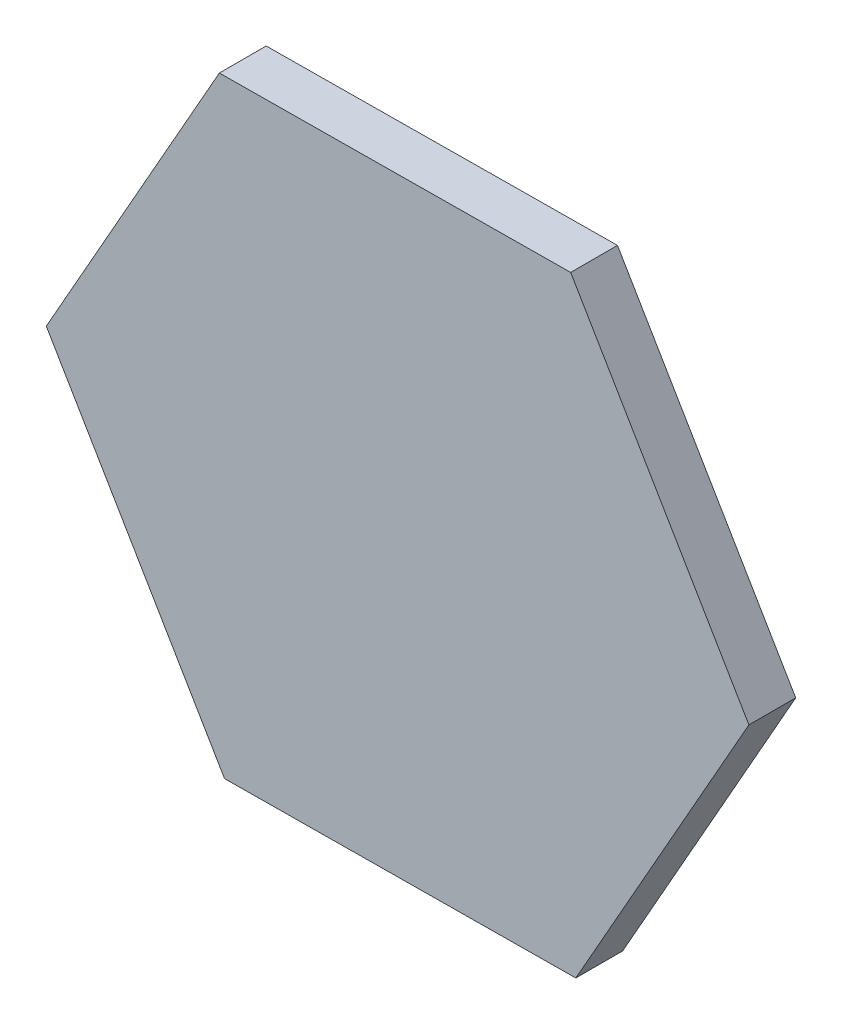
ISO-10303-21;
HEADER;
FILE_DESCRIPTION(('STEP AP214'),'2;1');
FILE_NAME('part.step','',(''),(''),'','','');
FILE_SCHEMA(('AUTOMOTIVE_DESIGN { 1 0 10303 214 1 1 1 1 }'));
ENDSEC;
DATA;
#1=APPLICATION_CONTEXT('core data for automotive mechanical design processes');
#2=APPLICATION_PROTOCOL_DEFINITION('international standard','automotive_design',2000,#1);
#3=PRODUCT_CONTEXT('',#1,'mechanical');
#4=PRODUCT('Part','Part','',(#3));
#5=PRODUCT_RELATED_PRODUCT_CATEGORY('part','',(#4));
#6=PRODUCT_DEFINITION_FORMATION('','',#4);
#7=PRODUCT_DEFINITION_CONTEXT('part definition',#1,'design');
#8=PRODUCT_DEFINITION('design','',#6,#7);
#9=PRODUCT_DEFINITION_SHAPE('','',#8);
#10=(LENGTH_UNIT() NAMED_UNIT(*) SI_UNIT(.MILLI.,.METRE.));
#11=(NAMED_UNIT(*) PLANE_ANGLE_UNIT() SI_UNIT($,.RADIAN.));
#12=(NAMED_UNIT(*) SI_UNIT($,.STERADIAN.) SOLID_ANGLE_UNIT());
#13=UNCERTAINTY_MEASURE_WITH_UNIT(LENGTH_MEASURE(1.E-05),#10,'distance_accuracy_value','');
#14=(GEOMETRIC_REPRESENTATION_CONTEXT(3) GLOBAL_UNCERTAINTY_ASSIGNED_CONTEXT((#13)) GLOBAL_UNIT_ASSIGNED_CONTEXT((#10,
#11,#12)) REPRESENTATION_CONTEXT('',''));
#15=CARTESIAN_POINT('',(0.,0.,0.));
#16=DIRECTION('',(0.,0.,1.));
#17=DIRECTION('',(1.,0.,0.));
#18=AXIS2_PLACEMENT_3D('',#15,#16,#17);
#19=CARTESIAN_POINT('',(-7.50528285653604,-0.0637383457540854,1.));
#20=DIRECTION('',(0.861748096783526,0.507336394998399,0.));
#21=DIRECTION('',(-0.507336394998399,0.861748096783526,0.));
#22=AXIS2_PLACEMENT_3D('',#19,#20,#21);
#23=PLANE('',#22);
#24=DIRECTION('',(0.507336394998399,-0.861748096783526,0.));
#25=VECTOR('',#24,1.);
#26=CARTESIAN_POINT('',(-7.50528285653604,-0.0637383457540854,0.));
#27=LINE('',#26,#25);
#28=CARTESIAN_POINT('',(-7.50528285653604,-0.0637383457540854,0.));
#29=VERTEX_POINT('',#28);
#30=CARTESIAN_POINT('',(-3.69744240164979,-6.5316347892251,0.));
#31=VERTEX_POINT('',#30);
#32=EDGE_CURVE('E123',#29,#31,#27,.T.);
#33=ORIENTED_EDGE('',*,*,#32,.T.);
#34=DIRECTION('',(0.,0.,-1.));
#35=VECTOR('',#34,1.);
#36=CARTESIAN_POINT('',(-3.69744240164979,-6.5316347892251,1.));
#37=LINE('',#36,#35);
#38=CARTESIAN_POINT('',(-3.69744240164979,-6.5316347892251,1.));
#39=VERTEX_POINT('',#38);
#40=EDGE_CURVE('E11',#39,#31,#37,.T.);
#41=ORIENTED_EDGE('',*,*,#40,.F.);
#42=DIRECTION('',(0.507336394998399,-0.861748096783526,0.));
#43=VECTOR('',#42,1.);
#44=CARTESIAN_POINT('',(-7.50528285653604,-0.0637383457540854,1.));
#45=LINE('',#44,#43);
#46=CARTESIAN_POINT('',(-7.50528285653604,-0.0637383457540854,1.));
#47=VERTEX_POINT('',#46);
#48=EDGE_CURVE('E133',#47,#39,#45,.T.);
#49=ORIENTED_EDGE('',*,*,#48,.F.);
#50=DIRECTION('',(0.,0.,-1.));
#51=VECTOR('',#50,1.);
#52=CARTESIAN_POINT('',(-7.50528285653604,-0.0637383457540854,1.));
#53=LINE('',#52,#51);
#54=EDGE_CURVE('E119',#47,#29,#53,.T.);
#55=ORIENTED_EDGE('',*,*,#54,.T.);
#56=EDGE_LOOP('',(#33,#41,#49,#55));
#57=FACE_BOUND('',#56,.T.);
#58=ADVANCED_FACE('F39',(#57),#23,.F.);
#59=CARTESIAN_POINT('',(-3.69744240164979,-6.5316347892251,1.));
#60=DIRECTION('',(-0.0084921579412667,0.999963940976624,0.));
#61=DIRECTION('',(-0.999963940976624,-0.0084921579412667,0.));
#62=AXIS2_PLACEMENT_3D('',#59,#60,#61);
#63=PLANE('',#62);
#64=DIRECTION('',(0.999963940976624,0.0084921579412667,0.));
#65=VECTOR('',#64,1.);
#66=CARTESIAN_POINT('',(-3.69744240164979,-6.5316347892251,0.));
#67=LINE('',#66,#65);
#68=CARTESIAN_POINT('',(3.80784045488625,-6.46789644347101,0.));
#69=VERTEX_POINT('',#68);
#70=EDGE_CURVE('E126',#31,#69,#67,.T.);
#71=ORIENTED_EDGE('',*,*,#70,.T.);
#72=DIRECTION('',(0.,0.,-1.));
#73=VECTOR('',#72,1.);
#74=CARTESIAN_POINT('',(3.80784045488625,-6.46789644347101,1.));
#75=LINE('',#74,#73);
#76=CARTESIAN_POINT('',(3.80784045488625,-6.46789644347101,1.));
#77=VERTEX_POINT('',#76);
#78=EDGE_CURVE('E47',#77,#69,#75,.T.);
#79=ORIENTED_EDGE('',*,*,#78,.F.);
#80=DIRECTION('',(0.999963940976624,0.0084921579412667,0.));
#81=VECTOR('',#80,1.);
#82=CARTESIAN_POINT('',(-3.69744240164979,-6.5316347892251,1.));
#83=LINE('',#82,#81);
#84=EDGE_CURVE('E92',#39,#77,#83,.T.);
#85=ORIENTED_EDGE('',*,*,#84,.F.);
#86=ORIENTED_EDGE('',*,*,#40,.T.);
#87=EDGE_LOOP('',(#71,#79,#85,#86));
#88=FACE_BOUND('',#87,.T.);
#89=ADVANCED_FACE('F157',(#88),#63,.F.);
#90=CARTESIAN_POINT('',(3.80784045488625,-6.46789644347101,1.));
#91=DIRECTION('',(-0.870240254724793,0.492627545978225,0.));
#92=DIRECTION('',(-0.492627545978225,-0.870240254724793,0.));
#93=AXIS2_PLACEMENT_3D('',#90,#91,#92);
#94=PLANE('',#93);
#95=DIRECTION('',(0.492627545978225,0.870240254724793,0.));
#96=VECTOR('',#95,1.);
#97=CARTESIAN_POINT('',(3.80784045488625,-6.46789644347101,0.));
#98=LINE('',#97,#96);
#99=CARTESIAN_POINT('',(7.50528285653604,0.063738345754087,0.));
#100=VERTEX_POINT('',#99);
#101=EDGE_CURVE('E128',#69,#100,#98,.T.);
#102=ORIENTED_EDGE('',*,*,#101,.T.);
#103=DIRECTION('',(0.,0.,-1.));
#104=VECTOR('',#103,1.);
#105=CARTESIAN_POINT('',(7.50528285653604,0.063738345754087,1.));
#106=LINE('',#105,#104);
#107=CARTESIAN_POINT('',(7.50528285653604,0.063738345754087,1.));
#108=VERTEX_POINT('',#107);
#109=EDGE_CURVE('E114',#108,#100,#106,.T.);
#110=ORIENTED_EDGE('',*,*,#109,.F.);
#111=DIRECTION('',(0.492627545978225,0.870240254724793,0.));
#112=VECTOR('',#111,1.);
#113=CARTESIAN_POINT('',(3.80784045488625,-6.46789644347101,1.));
#114=LINE('',#113,#112);
#115=EDGE_CURVE('E105',#77,#108,#114,.T.);
#116=ORIENTED_EDGE('',*,*,#115,.F.);
#117=ORIENTED_EDGE('',*,*,#78,.T.);
#118=EDGE_LOOP('',(#102,#110,#116,#117));
#119=FACE_BOUND('',#118,.T.);
#120=ADVANCED_FACE('F139',(#119),#94,.F.);
#121=CARTESIAN_POINT('',(7.50528285653604,0.063738345754087,1.));
#122=DIRECTION('',(-0.861748096783526,-0.507336394998399,0.));
#123=DIRECTION('',(0.507336394998399,-0.861748096783526,0.));
#124=AXIS2_PLACEMENT_3D('',#121,#122,#123);
#125=PLANE('',#124);
#126=DIRECTION('',(-0.507336394998399,0.861748096783526,0.));
#127=VECTOR('',#126,1.);
#128=CARTESIAN_POINT('',(7.50528285653604,0.063738345754087,0.));
#129=LINE('',#128,#127);
#130=CARTESIAN_POINT('',(3.69744240164979,6.5316347892251,0.));
#131=VERTEX_POINT('',#130);
#132=EDGE_CURVE('E113',#100,#131,#129,.T.);
#133=ORIENTED_EDGE('',*,*,#132,.T.);
#134=DIRECTION('',(0.,0.,-1.));
#135=VECTOR('',#134,1.);
#136=CARTESIAN_POINT('',(3.69744240164979,6.5316347892251,1.));
#137=LINE('',#136,#135);
#138=CARTESIAN_POINT('',(3.69744240164979,6.5316347892251,1.));
#139=VERTEX_POINT('',#138);
#140=EDGE_CURVE('E110',#139,#131,#137,.T.);
#141=ORIENTED_EDGE('',*,*,#140,.F.);
#142=DIRECTION('',(-0.507336394998399,0.861748096783526,0.));
#143=VECTOR('',#142,1.);
#144=CARTESIAN_POINT('',(7.50528285653604,0.063738345754087,1.));
#145=LINE('',#144,#143);
#146=EDGE_CURVE('E99',#108,#139,#145,.T.);
#147=ORIENTED_EDGE('',*,*,#146,.F.);
#148=ORIENTED_EDGE('',*,*,#109,.T.);
#149=EDGE_LOOP('',(#133,#141,#147,#148));
#150=FACE_BOUND('',#149,.T.);
#151=ADVANCED_FACE('F111',(#150),#125,.F.);
#152=CARTESIAN_POINT('',(3.69744240164979,6.5316347892251,1.));
#153=DIRECTION('',(0.00849215794126625,-0.999963940976624,0.));
#154=DIRECTION('',(0.999963940976624,0.00849215794126625,0.));
#155=AXIS2_PLACEMENT_3D('',#152,#153,#154);
#156=PLANE('',#155);
#157=DIRECTION('',(-0.999963940976624,-0.00849215794126625,0.));
#158=VECTOR('',#157,1.);
#159=CARTESIAN_POINT('',(3.69744240164979,6.5316347892251,0.));
#160=LINE('',#159,#158);
#161=CARTESIAN_POINT('',(-3.80784045488625,6.46789644347101,0.));
#162=VERTEX_POINT('',#161);
#163=EDGE_CURVE('E78',#131,#162,#160,.T.);
#164=ORIENTED_EDGE('',*,*,#163,.T.);
#165=DIRECTION('',(0.,0.,-1.));
#166=VECTOR('',#165,1.);
#167=CARTESIAN_POINT('',(-3.80784045488625,6.46789644347101,1.));
#168=LINE('',#167,#166);
#169=CARTESIAN_POINT('',(-3.80784045488625,6.46789644347101,1.));
#170=VERTEX_POINT('',#169);
#171=EDGE_CURVE('E115',#170,#162,#168,.T.);
#172=ORIENTED_EDGE('',*,*,#171,.F.);
#173=DIRECTION('',(-0.999963940976624,-0.00849215794126625,0.));
#174=VECTOR('',#173,1.);
#175=CARTESIAN_POINT('',(3.69744240164979,6.5316347892251,1.));
#176=LINE('',#175,#174);
#177=EDGE_CURVE('E103',#139,#170,#176,.T.);
#178=ORIENTED_EDGE('',*,*,#177,.F.);
#179=ORIENTED_EDGE('',*,*,#140,.T.);
#180=EDGE_LOOP('',(#164,#172,#178,#179));
#181=FACE_BOUND('',#180,.T.);
#182=ADVANCED_FACE('F117',(#181),#156,.F.);
#183=CARTESIAN_POINT('',(-3.80784045488625,6.46789644347101,1.));
#184=DIRECTION('',(0.870240254724792,-0.492627545978225,0.));
#185=DIRECTION('',(0.492627545978226,0.870240254724792,0.));
#186=AXIS2_PLACEMENT_3D('',#183,#184,#185);
#187=PLANE('',#186);
#188=DIRECTION('',(-0.492627545978225,-0.870240254724792,0.));
#189=VECTOR('',#188,1.);
#190=CARTESIAN_POINT('',(-3.80784045488625,6.46789644347101,0.));
#191=LINE('',#190,#189);
#192=EDGE_CURVE('E84',#162,#29,#191,.T.);
#193=ORIENTED_EDGE('',*,*,#192,.T.);
#194=ORIENTED_EDGE('',*,*,#54,.F.);
#195=DIRECTION('',(-0.492627545978225,-0.870240254724792,0.));
#196=VECTOR('',#195,1.);
#197=CARTESIAN_POINT('',(-3.80784045488625,6.46789644347101,1.));
#198=LINE('',#197,#196);
#199=EDGE_CURVE('E55',#170,#47,#198,.T.);
#200=ORIENTED_EDGE('',*,*,#199,.F.);
#201=ORIENTED_EDGE('',*,*,#171,.T.);
#202=EDGE_LOOP('',(#193,#194,#200,#201));
#203=FACE_BOUND('',#202,.T.);
#204=ADVANCED_FACE('F146',(#203),#187,.F.);
#205=CARTESIAN_POINT('',(0.,0.,1.));
#206=DIRECTION('',(0.,0.,1.));
#207=DIRECTION('',(1.,0.,0.));
#208=AXIS2_PLACEMENT_3D('',#205,#206,#207);
#209=PLANE('',#208);
#210=ORIENTED_EDGE('',*,*,#48,.T.);
#211=ORIENTED_EDGE('',*,*,#84,.T.);
#212=ORIENTED_EDGE('',*,*,#115,.T.);
#213=ORIENTED_EDGE('',*,*,#146,.T.);
#214=ORIENTED_EDGE('',*,*,#177,.T.);
#215=ORIENTED_EDGE('',*,*,#199,.T.);
#216=EDGE_LOOP('',(#210,#211,#212,#213,#214,#215));
#217=FACE_BOUND('',#216,.T.);
#218=ADVANCED_FACE('F101',(#217),#209,.T.);
#219=CARTESIAN_POINT('',(0.,0.,0.));
#220=DIRECTION('',(0.,0.,1.));
#221=DIRECTION('',(1.,0.,0.));
#222=AXIS2_PLACEMENT_3D('',#219,#220,#221);
#223=PLANE('',#222);
#224=ORIENTED_EDGE('',*,*,#32,.F.);
#225=ORIENTED_EDGE('',*,*,#192,.F.);
#226=ORIENTED_EDGE('',*,*,#163,.F.);
#227=ORIENTED_EDGE('',*,*,#132,.F.);
#228=ORIENTED_EDGE('',*,*,#101,.F.);
#229=ORIENTED_EDGE('',*,*,#70,.F.);
#230=EDGE_LOOP('',(#224,#225,#226,#227,#228,#229));
#231=FACE_BOUND('',#230,.T.);
#232=ADVANCED_FACE('F142',(#231),#223,.F.);
#233=CLOSED_SHELL('',(#58,#89,#120,#151,#182,#204,#218,#232));
#234=MANIFOLD_SOLID_BREP('B2',#233);
#235=ADVANCED_BREP_SHAPE_REPRESENTATION('',(#18,#234),#14);
#236=SHAPE_DEFINITION_REPRESENTATION(#9,#235);
ENDSEC;
END-ISO-10303-21;
